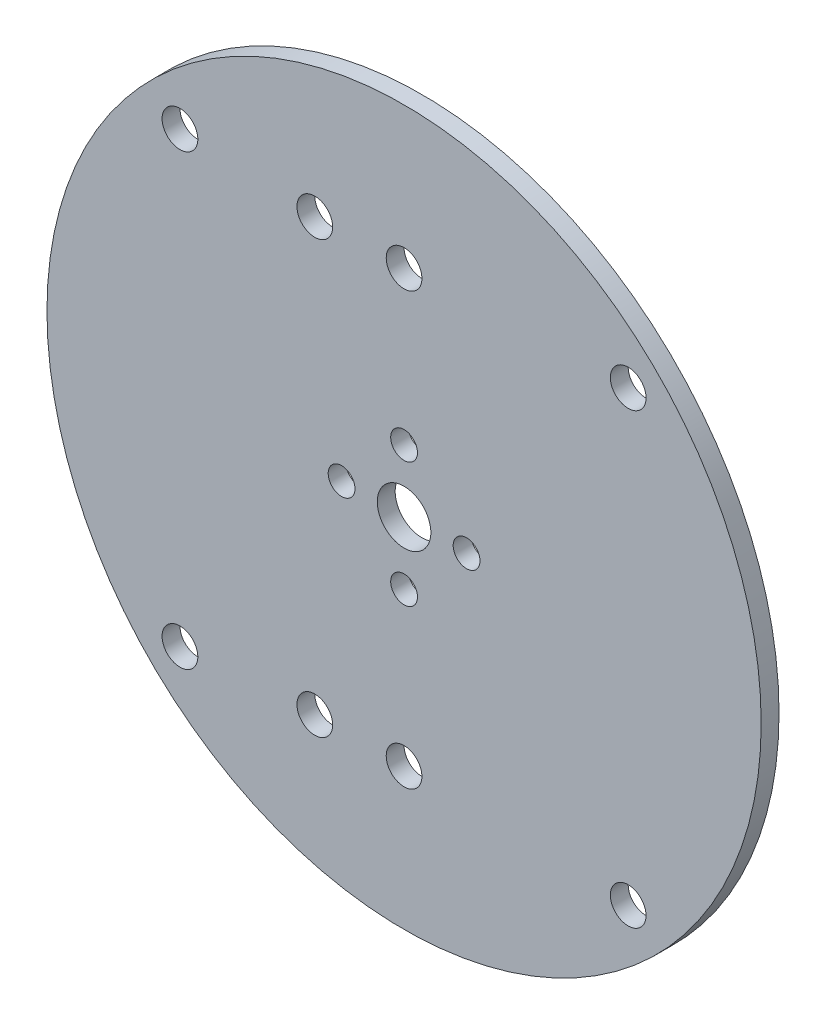
ISO-10303-21;
HEADER;
FILE_DESCRIPTION(('STEP AP214'),'2;1');
FILE_NAME('part.step','',(''),(''),'','','');
FILE_SCHEMA(('AUTOMOTIVE_DESIGN { 1 0 10303 214 1 1 1 1 }'));
ENDSEC;
DATA;
#1=APPLICATION_CONTEXT('core data for automotive mechanical design processes');
#2=APPLICATION_PROTOCOL_DEFINITION('international standard','automotive_design',2000,#1);
#3=PRODUCT_CONTEXT('',#1,'mechanical');
#4=PRODUCT('Part','Part','',(#3));
#5=PRODUCT_RELATED_PRODUCT_CATEGORY('part','',(#4));
#6=PRODUCT_DEFINITION_FORMATION('','',#4);
#7=PRODUCT_DEFINITION_CONTEXT('part definition',#1,'design');
#8=PRODUCT_DEFINITION('design','',#6,#7);
#9=PRODUCT_DEFINITION_SHAPE('','',#8);
#10=(LENGTH_UNIT() NAMED_UNIT(*) SI_UNIT(.MILLI.,.METRE.));
#11=(NAMED_UNIT(*) PLANE_ANGLE_UNIT() SI_UNIT($,.RADIAN.));
#12=(NAMED_UNIT(*) SI_UNIT($,.STERADIAN.) SOLID_ANGLE_UNIT());
#13=UNCERTAINTY_MEASURE_WITH_UNIT(LENGTH_MEASURE(1.E-05),#10,'distance_accuracy_value','');
#14=(GEOMETRIC_REPRESENTATION_CONTEXT(3) GLOBAL_UNCERTAINTY_ASSIGNED_CONTEXT((#13)) GLOBAL_UNIT_ASSIGNED_CONTEXT((#10,
#11,#12)) REPRESENTATION_CONTEXT('',''));
#15=CARTESIAN_POINT('',(0.,0.,0.));
#16=DIRECTION('',(0.,0.,1.));
#17=DIRECTION('',(1.,0.,0.));
#18=AXIS2_PLACEMENT_3D('',#15,#16,#17);
#19=CARTESIAN_POINT('',(64.7426065483763,40.5692941488828,2.));
#20=DIRECTION('',(0.,0.,1.));
#21=DIRECTION('',(1.,0.,0.));
#22=AXIS2_PLACEMENT_3D('',#19,#20,#21);
#23=PLANE('',#22);
#24=CARTESIAN_POINT('',(64.7426065483763,40.5692941488828,2.));
#25=DIRECTION('',(0.,0.,-1.));
#26=DIRECTION('',(-1.,0.,0.));
#27=AXIS2_PLACEMENT_3D('',#24,#25,#26);
#28=CIRCLE('',#27,40.);
#29=CARTESIAN_POINT('',(24.7426065483763,40.5692941488828,2.));
#30=VERTEX_POINT('',#29);
#31=EDGE_CURVE('E65',#30,#30,#28,.T.);
#32=ORIENTED_EDGE('',*,*,#31,.F.);
#33=EDGE_LOOP('',(#32));
#34=FACE_BOUND('',#33,.T.);
#35=CARTESIAN_POINT('',(64.7426065483763,40.5692941488828,2.));
#36=DIRECTION('',(0.,0.,-1.));
#37=DIRECTION('',(-1.,0.,0.));
#38=AXIS2_PLACEMENT_3D('',#35,#36,#37);
#39=CIRCLE('',#38,3.);
#40=CARTESIAN_POINT('',(61.7426065483763,40.5692941488828,2.));
#41=VERTEX_POINT('',#40);
#42=EDGE_CURVE('E68',#41,#41,#39,.T.);
#43=ORIENTED_EDGE('',*,*,#42,.T.);
#44=EDGE_LOOP('',(#43));
#45=FACE_BOUND('',#44,.T.);
#46=CARTESIAN_POINT('',(71.7426065483763,40.5692941488828,2.));
#47=DIRECTION('',(0.,0.,-1.));
#48=DIRECTION('',(-1.,0.,0.));
#49=AXIS2_PLACEMENT_3D('',#46,#47,#48);
#50=CIRCLE('',#49,1.49999999999995);
#51=CARTESIAN_POINT('',(70.2426065483764,40.5692941488828,2.));
#52=VERTEX_POINT('',#51);
#53=EDGE_CURVE('E71',#52,#52,#50,.T.);
#54=ORIENTED_EDGE('',*,*,#53,.T.);
#55=EDGE_LOOP('',(#54));
#56=FACE_BOUND('',#55,.T.);
#57=CARTESIAN_POINT('',(57.7426065483763,40.5692941488828,2.));
#58=DIRECTION('',(0.,0.,-1.));
#59=DIRECTION('',(-1.,0.,0.));
#60=AXIS2_PLACEMENT_3D('',#57,#58,#59);
#61=CIRCLE('',#60,1.49999999999995);
#62=CARTESIAN_POINT('',(56.2426065483764,40.5692941488828,2.));
#63=VERTEX_POINT('',#62);
#64=EDGE_CURVE('E74',#63,#63,#61,.T.);
#65=ORIENTED_EDGE('',*,*,#64,.T.);
#66=EDGE_LOOP('',(#65));
#67=FACE_BOUND('',#66,.T.);
#68=CARTESIAN_POINT('',(89.8448972804962,15.4670034167627,2.));
#69=DIRECTION('',(0.,0.,-1.));
#70=DIRECTION('',(-1.,0.,0.));
#71=AXIS2_PLACEMENT_3D('',#68,#69,#70);
#72=CIRCLE('',#71,2.);
#73=CARTESIAN_POINT('',(87.8448972804962,15.4670034167627,2.));
#74=VERTEX_POINT('',#73);
#75=EDGE_CURVE('E77',#74,#74,#72,.T.);
#76=ORIENTED_EDGE('',*,*,#75,.T.);
#77=EDGE_LOOP('',(#76));
#78=FACE_BOUND('',#77,.T.);
#79=CARTESIAN_POINT('',(54.7426065483772,64.7142941488828,2.));
#80=DIRECTION('',(0.,0.,-1.));
#81=DIRECTION('',(-1.,0.,0.));
#82=AXIS2_PLACEMENT_3D('',#79,#80,#81);
#83=CIRCLE('',#82,2.);
#84=CARTESIAN_POINT('',(52.7426065483772,64.7142941488828,2.));
#85=VERTEX_POINT('',#84);
#86=EDGE_CURVE('E80',#85,#85,#83,.T.);
#87=ORIENTED_EDGE('',*,*,#86,.T.);
#88=EDGE_LOOP('',(#87));
#89=FACE_BOUND('',#88,.T.);
#90=CARTESIAN_POINT('',(39.6403158162561,15.4670034167627,2.));
#91=DIRECTION('',(0.,0.,-1.));
#92=DIRECTION('',(-1.,0.,0.));
#93=AXIS2_PLACEMENT_3D('',#90,#91,#92);
#94=CIRCLE('',#93,2.);
#95=CARTESIAN_POINT('',(37.6403158162561,15.4670034167627,2.));
#96=VERTEX_POINT('',#95);
#97=EDGE_CURVE('E83',#96,#96,#94,.T.);
#98=ORIENTED_EDGE('',*,*,#97,.T.);
#99=EDGE_LOOP('',(#98));
#100=FACE_BOUND('',#99,.T.);
#101=CARTESIAN_POINT('',(89.8448972804962,65.6715848810028,2.));
#102=DIRECTION('',(0.,0.,-1.));
#103=DIRECTION('',(-1.,0.,0.));
#104=AXIS2_PLACEMENT_3D('',#101,#102,#103);
#105=CIRCLE('',#104,2.);
#106=CARTESIAN_POINT('',(87.8448972804962,65.6715848810028,2.));
#107=VERTEX_POINT('',#106);
#108=EDGE_CURVE('E86',#107,#107,#105,.T.);
#109=ORIENTED_EDGE('',*,*,#108,.T.);
#110=EDGE_LOOP('',(#109));
#111=FACE_BOUND('',#110,.T.);
#112=CARTESIAN_POINT('',(39.6403158162561,65.6715848810028,2.));
#113=DIRECTION('',(0.,0.,-1.));
#114=DIRECTION('',(-1.,0.,0.));
#115=AXIS2_PLACEMENT_3D('',#112,#113,#114);
#116=CIRCLE('',#115,2.);
#117=CARTESIAN_POINT('',(37.6403158162561,65.6715848810028,2.));
#118=VERTEX_POINT('',#117);
#119=EDGE_CURVE('E89',#118,#118,#116,.T.);
#120=ORIENTED_EDGE('',*,*,#119,.T.);
#121=EDGE_LOOP('',(#120));
#122=FACE_BOUND('',#121,.T.);
#123=CARTESIAN_POINT('',(64.7426065483763,64.7142941488828,2.));
#124=DIRECTION('',(0.,0.,-1.));
#125=DIRECTION('',(-1.,0.,0.));
#126=AXIS2_PLACEMENT_3D('',#123,#124,#125);
#127=CIRCLE('',#126,2.);
#128=CARTESIAN_POINT('',(62.7426065483763,64.7142941488828,2.));
#129=VERTEX_POINT('',#128);
#130=EDGE_CURVE('E92',#129,#129,#127,.T.);
#131=ORIENTED_EDGE('',*,*,#130,.T.);
#132=EDGE_LOOP('',(#131));
#133=FACE_BOUND('',#132,.T.);
#134=CARTESIAN_POINT('',(64.7426065483763,16.4142941488828,2.));
#135=DIRECTION('',(0.,0.,-1.));
#136=DIRECTION('',(-1.,0.,0.));
#137=AXIS2_PLACEMENT_3D('',#134,#135,#136);
#138=CIRCLE('',#137,2.);
#139=CARTESIAN_POINT('',(62.7426065483763,16.4142941488828,2.));
#140=VERTEX_POINT('',#139);
#141=EDGE_CURVE('E95',#140,#140,#138,.T.);
#142=ORIENTED_EDGE('',*,*,#141,.T.);
#143=EDGE_LOOP('',(#142));
#144=FACE_BOUND('',#143,.T.);
#145=CARTESIAN_POINT('',(64.7426065483763,33.5692941488828,2.));
#146=DIRECTION('',(0.,0.,-1.));
#147=DIRECTION('',(-1.,0.,0.));
#148=AXIS2_PLACEMENT_3D('',#145,#146,#147);
#149=CIRCLE('',#148,1.49999999999995);
#150=CARTESIAN_POINT('',(63.2426065483764,33.5692941488828,2.));
#151=VERTEX_POINT('',#150);
#152=EDGE_CURVE('E98',#151,#151,#149,.T.);
#153=ORIENTED_EDGE('',*,*,#152,.T.);
#154=EDGE_LOOP('',(#153));
#155=FACE_BOUND('',#154,.T.);
#156=CARTESIAN_POINT('',(64.7426065483763,47.5692941488828,2.));
#157=DIRECTION('',(0.,0.,-1.));
#158=DIRECTION('',(-1.,0.,0.));
#159=AXIS2_PLACEMENT_3D('',#156,#157,#158);
#160=CIRCLE('',#159,1.49999999999995);
#161=CARTESIAN_POINT('',(63.2426065483764,47.5692941488828,2.));
#162=VERTEX_POINT('',#161);
#163=EDGE_CURVE('E100',#162,#162,#160,.T.);
#164=ORIENTED_EDGE('',*,*,#163,.T.);
#165=EDGE_LOOP('',(#164));
#166=FACE_BOUND('',#165,.T.);
#167=CARTESIAN_POINT('',(54.7426065483772,16.4142941488828,2.));
#168=DIRECTION('',(0.,0.,-1.));
#169=DIRECTION('',(-1.,0.,0.));
#170=AXIS2_PLACEMENT_3D('',#167,#168,#169);
#171=CIRCLE('',#170,2.);
#172=CARTESIAN_POINT('',(52.7426065483772,16.4142941488828,2.));
#173=VERTEX_POINT('',#172);
#174=EDGE_CURVE('E18',#173,#173,#171,.T.);
#175=ORIENTED_EDGE('',*,*,#174,.T.);
#176=EDGE_LOOP('',(#175));
#177=FACE_BOUND('',#176,.T.);
#178=ADVANCED_FACE('F15',(#34,#45,#56,#67,#78,#89,#100,#111,#122,#133,#144,#155,#166,#177),#23,.T.);
#179=CARTESIAN_POINT('',(54.7426065483772,16.4142941488828,2.));
#180=DIRECTION('',(0.,0.,-1.));
#181=DIRECTION('',(-1.,0.,0.));
#182=AXIS2_PLACEMENT_3D('',#179,#180,#181);
#183=CYLINDRICAL_SURFACE('',#182,2.);
#184=CARTESIAN_POINT('',(54.7426065483772,16.4142941488828,0.));
#185=DIRECTION('',(0.,0.,-1.));
#186=DIRECTION('',(-1.,0.,0.));
#187=AXIS2_PLACEMENT_3D('',#184,#185,#186);
#188=CIRCLE('',#187,2.);
#189=CARTESIAN_POINT('',(52.7426065483772,16.4142941488828,0.));
#190=VERTEX_POINT('',#189);
#191=EDGE_CURVE('E62',#190,#190,#188,.T.);
#192=ORIENTED_EDGE('',*,*,#191,.T.);
#193=EDGE_LOOP('',(#192));
#194=FACE_BOUND('',#193,.T.);
#195=ORIENTED_EDGE('',*,*,#174,.F.);
#196=EDGE_LOOP('',(#195));
#197=FACE_BOUND('',#196,.T.);
#198=ADVANCED_FACE('F108',(#194,#197),#183,.F.);
#199=CARTESIAN_POINT('',(64.7426065483763,47.5692941488828,2.));
#200=DIRECTION('',(0.,0.,-1.));
#201=DIRECTION('',(-1.,0.,0.));
#202=AXIS2_PLACEMENT_3D('',#199,#200,#201);
#203=CYLINDRICAL_SURFACE('',#202,1.49999999999995);
#204=CARTESIAN_POINT('',(64.7426065483763,47.5692941488828,0.));
#205=DIRECTION('',(0.,0.,-1.));
#206=DIRECTION('',(-1.,0.,0.));
#207=AXIS2_PLACEMENT_3D('',#204,#205,#206);
#208=CIRCLE('',#207,1.49999999999995);
#209=CARTESIAN_POINT('',(63.2426065483764,47.5692941488828,0.));
#210=VERTEX_POINT('',#209);
#211=EDGE_CURVE('E59',#210,#210,#208,.T.);
#212=ORIENTED_EDGE('',*,*,#211,.T.);
#213=EDGE_LOOP('',(#212));
#214=FACE_BOUND('',#213,.T.);
#215=ORIENTED_EDGE('',*,*,#163,.F.);
#216=EDGE_LOOP('',(#215));
#217=FACE_BOUND('',#216,.T.);
#218=ADVANCED_FACE('F110',(#214,#217),#203,.F.);
#219=CARTESIAN_POINT('',(64.7426065483763,33.5692941488828,2.));
#220=DIRECTION('',(0.,0.,-1.));
#221=DIRECTION('',(-1.,0.,0.));
#222=AXIS2_PLACEMENT_3D('',#219,#220,#221);
#223=CYLINDRICAL_SURFACE('',#222,1.49999999999995);
#224=CARTESIAN_POINT('',(64.7426065483763,33.5692941488828,0.));
#225=DIRECTION('',(0.,0.,-1.));
#226=DIRECTION('',(-1.,0.,0.));
#227=AXIS2_PLACEMENT_3D('',#224,#225,#226);
#228=CIRCLE('',#227,1.49999999999995);
#229=CARTESIAN_POINT('',(63.2426065483764,33.5692941488828,0.));
#230=VERTEX_POINT('',#229);
#231=EDGE_CURVE('E56',#230,#230,#228,.T.);
#232=ORIENTED_EDGE('',*,*,#231,.T.);
#233=EDGE_LOOP('',(#232));
#234=FACE_BOUND('',#233,.T.);
#235=ORIENTED_EDGE('',*,*,#152,.F.);
#236=EDGE_LOOP('',(#235));
#237=FACE_BOUND('',#236,.T.);
#238=ADVANCED_FACE('F117',(#234,#237),#223,.F.);
#239=CARTESIAN_POINT('',(64.7426065483763,16.4142941488828,2.));
#240=DIRECTION('',(0.,0.,-1.));
#241=DIRECTION('',(-1.,0.,0.));
#242=AXIS2_PLACEMENT_3D('',#239,#240,#241);
#243=CYLINDRICAL_SURFACE('',#242,2.);
#244=CARTESIAN_POINT('',(64.7426065483763,16.4142941488828,0.));
#245=DIRECTION('',(0.,0.,-1.));
#246=DIRECTION('',(-1.,0.,0.));
#247=AXIS2_PLACEMENT_3D('',#244,#245,#246);
#248=CIRCLE('',#247,2.);
#249=CARTESIAN_POINT('',(62.7426065483763,16.4142941488828,0.));
#250=VERTEX_POINT('',#249);
#251=EDGE_CURVE('E53',#250,#250,#248,.T.);
#252=ORIENTED_EDGE('',*,*,#251,.T.);
#253=EDGE_LOOP('',(#252));
#254=FACE_BOUND('',#253,.T.);
#255=ORIENTED_EDGE('',*,*,#141,.F.);
#256=EDGE_LOOP('',(#255));
#257=FACE_BOUND('',#256,.T.);
#258=ADVANCED_FACE('F168',(#254,#257),#243,.F.);
#259=CARTESIAN_POINT('',(64.7426065483763,64.7142941488828,2.));
#260=DIRECTION('',(0.,0.,-1.));
#261=DIRECTION('',(-1.,0.,0.));
#262=AXIS2_PLACEMENT_3D('',#259,#260,#261);
#263=CYLINDRICAL_SURFACE('',#262,2.);
#264=CARTESIAN_POINT('',(64.7426065483763,64.7142941488828,0.));
#265=DIRECTION('',(0.,0.,-1.));
#266=DIRECTION('',(-1.,0.,0.));
#267=AXIS2_PLACEMENT_3D('',#264,#265,#266);
#268=CIRCLE('',#267,2.);
#269=CARTESIAN_POINT('',(62.7426065483763,64.7142941488828,0.));
#270=VERTEX_POINT('',#269);
#271=EDGE_CURVE('E50',#270,#270,#268,.T.);
#272=ORIENTED_EDGE('',*,*,#271,.T.);
#273=EDGE_LOOP('',(#272));
#274=FACE_BOUND('',#273,.T.);
#275=ORIENTED_EDGE('',*,*,#130,.F.);
#276=EDGE_LOOP('',(#275));
#277=FACE_BOUND('',#276,.T.);
#278=ADVANCED_FACE('F164',(#274,#277),#263,.F.);
#279=CARTESIAN_POINT('',(39.6403158162561,65.6715848810028,2.));
#280=DIRECTION('',(0.,0.,-1.));
#281=DIRECTION('',(-1.,0.,0.));
#282=AXIS2_PLACEMENT_3D('',#279,#280,#281);
#283=CYLINDRICAL_SURFACE('',#282,2.);
#284=CARTESIAN_POINT('',(39.6403158162561,65.6715848810028,0.));
#285=DIRECTION('',(0.,0.,-1.));
#286=DIRECTION('',(-1.,0.,0.));
#287=AXIS2_PLACEMENT_3D('',#284,#285,#286);
#288=CIRCLE('',#287,2.);
#289=CARTESIAN_POINT('',(37.6403158162561,65.6715848810028,0.));
#290=VERTEX_POINT('',#289);
#291=EDGE_CURVE('E47',#290,#290,#288,.T.);
#292=ORIENTED_EDGE('',*,*,#291,.T.);
#293=EDGE_LOOP('',(#292));
#294=FACE_BOUND('',#293,.T.);
#295=ORIENTED_EDGE('',*,*,#119,.F.);
#296=EDGE_LOOP('',(#295));
#297=FACE_BOUND('',#296,.T.);
#298=ADVANCED_FACE('F160',(#294,#297),#283,.F.);
#299=CARTESIAN_POINT('',(89.8448972804962,65.6715848810028,2.));
#300=DIRECTION('',(0.,0.,-1.));
#301=DIRECTION('',(-1.,0.,0.));
#302=AXIS2_PLACEMENT_3D('',#299,#300,#301);
#303=CYLINDRICAL_SURFACE('',#302,2.);
#304=CARTESIAN_POINT('',(89.8448972804962,65.6715848810028,0.));
#305=DIRECTION('',(0.,0.,-1.));
#306=DIRECTION('',(-1.,0.,0.));
#307=AXIS2_PLACEMENT_3D('',#304,#305,#306);
#308=CIRCLE('',#307,2.);
#309=CARTESIAN_POINT('',(87.8448972804962,65.6715848810028,0.));
#310=VERTEX_POINT('',#309);
#311=EDGE_CURVE('E44',#310,#310,#308,.T.);
#312=ORIENTED_EDGE('',*,*,#311,.T.);
#313=EDGE_LOOP('',(#312));
#314=FACE_BOUND('',#313,.T.);
#315=ORIENTED_EDGE('',*,*,#108,.F.);
#316=EDGE_LOOP('',(#315));
#317=FACE_BOUND('',#316,.T.);
#318=ADVANCED_FACE('F156',(#314,#317),#303,.F.);
#319=CARTESIAN_POINT('',(39.6403158162561,15.4670034167627,2.));
#320=DIRECTION('',(0.,0.,-1.));
#321=DIRECTION('',(-1.,0.,0.));
#322=AXIS2_PLACEMENT_3D('',#319,#320,#321);
#323=CYLINDRICAL_SURFACE('',#322,2.);
#324=CARTESIAN_POINT('',(39.6403158162561,15.4670034167627,0.));
#325=DIRECTION('',(0.,0.,-1.));
#326=DIRECTION('',(-1.,0.,0.));
#327=AXIS2_PLACEMENT_3D('',#324,#325,#326);
#328=CIRCLE('',#327,2.);
#329=CARTESIAN_POINT('',(37.6403158162561,15.4670034167627,0.));
#330=VERTEX_POINT('',#329);
#331=EDGE_CURVE('E41',#330,#330,#328,.T.);
#332=ORIENTED_EDGE('',*,*,#331,.T.);
#333=EDGE_LOOP('',(#332));
#334=FACE_BOUND('',#333,.T.);
#335=ORIENTED_EDGE('',*,*,#97,.F.);
#336=EDGE_LOOP('',(#335));
#337=FACE_BOUND('',#336,.T.);
#338=ADVANCED_FACE('F152',(#334,#337),#323,.F.);
#339=CARTESIAN_POINT('',(54.7426065483772,64.7142941488828,2.));
#340=DIRECTION('',(0.,0.,-1.));
#341=DIRECTION('',(-1.,0.,0.));
#342=AXIS2_PLACEMENT_3D('',#339,#340,#341);
#343=CYLINDRICAL_SURFACE('',#342,2.);
#344=CARTESIAN_POINT('',(54.7426065483772,64.7142941488828,0.));
#345=DIRECTION('',(0.,0.,-1.));
#346=DIRECTION('',(-1.,0.,0.));
#347=AXIS2_PLACEMENT_3D('',#344,#345,#346);
#348=CIRCLE('',#347,2.);
#349=CARTESIAN_POINT('',(52.7426065483772,64.7142941488828,0.));
#350=VERTEX_POINT('',#349);
#351=EDGE_CURVE('E38',#350,#350,#348,.T.);
#352=ORIENTED_EDGE('',*,*,#351,.T.);
#353=EDGE_LOOP('',(#352));
#354=FACE_BOUND('',#353,.T.);
#355=ORIENTED_EDGE('',*,*,#86,.F.);
#356=EDGE_LOOP('',(#355));
#357=FACE_BOUND('',#356,.T.);
#358=ADVANCED_FACE('F148',(#354,#357),#343,.F.);
#359=CARTESIAN_POINT('',(89.8448972804962,15.4670034167627,2.));
#360=DIRECTION('',(0.,0.,-1.));
#361=DIRECTION('',(-1.,0.,0.));
#362=AXIS2_PLACEMENT_3D('',#359,#360,#361);
#363=CYLINDRICAL_SURFACE('',#362,2.);
#364=CARTESIAN_POINT('',(89.8448972804962,15.4670034167627,0.));
#365=DIRECTION('',(0.,0.,-1.));
#366=DIRECTION('',(-1.,0.,0.));
#367=AXIS2_PLACEMENT_3D('',#364,#365,#366);
#368=CIRCLE('',#367,2.);
#369=CARTESIAN_POINT('',(87.8448972804962,15.4670034167627,0.));
#370=VERTEX_POINT('',#369);
#371=EDGE_CURVE('E35',#370,#370,#368,.T.);
#372=ORIENTED_EDGE('',*,*,#371,.T.);
#373=EDGE_LOOP('',(#372));
#374=FACE_BOUND('',#373,.T.);
#375=ORIENTED_EDGE('',*,*,#75,.F.);
#376=EDGE_LOOP('',(#375));
#377=FACE_BOUND('',#376,.T.);
#378=ADVANCED_FACE('F144',(#374,#377),#363,.F.);
#379=CARTESIAN_POINT('',(57.7426065483763,40.5692941488828,2.));
#380=DIRECTION('',(0.,0.,-1.));
#381=DIRECTION('',(-1.,0.,0.));
#382=AXIS2_PLACEMENT_3D('',#379,#380,#381);
#383=CYLINDRICAL_SURFACE('',#382,1.49999999999995);
#384=CARTESIAN_POINT('',(57.7426065483763,40.5692941488828,0.));
#385=DIRECTION('',(0.,0.,-1.));
#386=DIRECTION('',(-1.,0.,0.));
#387=AXIS2_PLACEMENT_3D('',#384,#385,#386);
#388=CIRCLE('',#387,1.49999999999995);
#389=CARTESIAN_POINT('',(56.2426065483764,40.5692941488828,0.));
#390=VERTEX_POINT('',#389);
#391=EDGE_CURVE('E32',#390,#390,#388,.T.);
#392=ORIENTED_EDGE('',*,*,#391,.T.);
#393=EDGE_LOOP('',(#392));
#394=FACE_BOUND('',#393,.T.);
#395=ORIENTED_EDGE('',*,*,#64,.F.);
#396=EDGE_LOOP('',(#395));
#397=FACE_BOUND('',#396,.T.);
#398=ADVANCED_FACE('F140',(#394,#397),#383,.F.);
#399=CARTESIAN_POINT('',(71.7426065483763,40.5692941488828,2.));
#400=DIRECTION('',(0.,0.,-1.));
#401=DIRECTION('',(-1.,0.,0.));
#402=AXIS2_PLACEMENT_3D('',#399,#400,#401);
#403=CYLINDRICAL_SURFACE('',#402,1.49999999999995);
#404=CARTESIAN_POINT('',(71.7426065483763,40.5692941488828,0.));
#405=DIRECTION('',(0.,0.,-1.));
#406=DIRECTION('',(-1.,0.,0.));
#407=AXIS2_PLACEMENT_3D('',#404,#405,#406);
#408=CIRCLE('',#407,1.49999999999995);
#409=CARTESIAN_POINT('',(70.2426065483764,40.5692941488828,0.));
#410=VERTEX_POINT('',#409);
#411=EDGE_CURVE('E27',#410,#410,#408,.T.);
#412=ORIENTED_EDGE('',*,*,#411,.T.);
#413=EDGE_LOOP('',(#412));
#414=FACE_BOUND('',#413,.T.);
#415=ORIENTED_EDGE('',*,*,#53,.F.);
#416=EDGE_LOOP('',(#415));
#417=FACE_BOUND('',#416,.T.);
#418=ADVANCED_FACE('F136',(#414,#417),#403,.F.);
#419=CARTESIAN_POINT('',(64.7426065483763,40.5692941488828,2.));
#420=DIRECTION('',(0.,0.,-1.));
#421=DIRECTION('',(-1.,0.,0.));
#422=AXIS2_PLACEMENT_3D('',#419,#420,#421);
#423=CYLINDRICAL_SURFACE('',#422,3.);
#424=CARTESIAN_POINT('',(64.7426065483763,40.5692941488828,0.));
#425=DIRECTION('',(0.,0.,-1.));
#426=DIRECTION('',(-1.,0.,0.));
#427=AXIS2_PLACEMENT_3D('',#424,#425,#426);
#428=CIRCLE('',#427,3.);
#429=CARTESIAN_POINT('',(61.7426065483763,40.5692941488828,0.));
#430=VERTEX_POINT('',#429);
#431=EDGE_CURVE('E22',#430,#430,#428,.T.);
#432=ORIENTED_EDGE('',*,*,#431,.T.);
#433=EDGE_LOOP('',(#432));
#434=FACE_BOUND('',#433,.T.);
#435=ORIENTED_EDGE('',*,*,#42,.F.);
#436=EDGE_LOOP('',(#435));
#437=FACE_BOUND('',#436,.T.);
#438=ADVANCED_FACE('F129',(#434,#437),#423,.F.);
#439=CARTESIAN_POINT('',(64.7426065483763,40.5692941488828,2.));
#440=DIRECTION('',(0.,0.,-1.));
#441=DIRECTION('',(-1.,0.,0.));
#442=AXIS2_PLACEMENT_3D('',#439,#440,#441);
#443=CYLINDRICAL_SURFACE('',#442,40.);
#444=ORIENTED_EDGE('',*,*,#31,.T.);
#445=EDGE_LOOP('',(#444));
#446=FACE_BOUND('',#445,.T.);
#447=CARTESIAN_POINT('',(64.7426065483763,40.5692941488828,0.));
#448=DIRECTION('',(0.,0.,-1.));
#449=DIRECTION('',(-1.,0.,0.));
#450=AXIS2_PLACEMENT_3D('',#447,#448,#449);
#451=CIRCLE('',#450,40.);
#452=CARTESIAN_POINT('',(24.7426065483763,40.5692941488828,0.));
#453=VERTEX_POINT('',#452);
#454=EDGE_CURVE('E10',#453,#453,#451,.F.);
#455=ORIENTED_EDGE('',*,*,#454,.T.);
#456=EDGE_LOOP('',(#455));
#457=FACE_BOUND('',#456,.T.);
#458=ADVANCED_FACE('F123',(#446,#457),#443,.T.);
#459=CARTESIAN_POINT('',(64.7426065483763,40.5692941488828,0.));
#460=DIRECTION('',(0.,0.,1.));
#461=DIRECTION('',(1.,0.,0.));
#462=AXIS2_PLACEMENT_3D('',#459,#460,#461);
#463=PLANE('',#462);
#464=ORIENTED_EDGE('',*,*,#454,.F.);
#465=EDGE_LOOP('',(#464));
#466=FACE_BOUND('',#465,.T.);
#467=ORIENTED_EDGE('',*,*,#431,.F.);
#468=EDGE_LOOP('',(#467));
#469=FACE_BOUND('',#468,.T.);
#470=ORIENTED_EDGE('',*,*,#411,.F.);
#471=EDGE_LOOP('',(#470));
#472=FACE_BOUND('',#471,.T.);
#473=ORIENTED_EDGE('',*,*,#391,.F.);
#474=EDGE_LOOP('',(#473));
#475=FACE_BOUND('',#474,.T.);
#476=ORIENTED_EDGE('',*,*,#371,.F.);
#477=EDGE_LOOP('',(#476));
#478=FACE_BOUND('',#477,.T.);
#479=ORIENTED_EDGE('',*,*,#351,.F.);
#480=EDGE_LOOP('',(#479));
#481=FACE_BOUND('',#480,.T.);
#482=ORIENTED_EDGE('',*,*,#331,.F.);
#483=EDGE_LOOP('',(#482));
#484=FACE_BOUND('',#483,.T.);
#485=ORIENTED_EDGE('',*,*,#311,.F.);
#486=EDGE_LOOP('',(#485));
#487=FACE_BOUND('',#486,.T.);
#488=ORIENTED_EDGE('',*,*,#291,.F.);
#489=EDGE_LOOP('',(#488));
#490=FACE_BOUND('',#489,.T.);
#491=ORIENTED_EDGE('',*,*,#271,.F.);
#492=EDGE_LOOP('',(#491));
#493=FACE_BOUND('',#492,.T.);
#494=ORIENTED_EDGE('',*,*,#251,.F.);
#495=EDGE_LOOP('',(#494));
#496=FACE_BOUND('',#495,.T.);
#497=ORIENTED_EDGE('',*,*,#231,.F.);
#498=EDGE_LOOP('',(#497));
#499=FACE_BOUND('',#498,.T.);
#500=ORIENTED_EDGE('',*,*,#211,.F.);
#501=EDGE_LOOP('',(#500));
#502=FACE_BOUND('',#501,.T.);
#503=ORIENTED_EDGE('',*,*,#191,.F.);
#504=EDGE_LOOP('',(#503));
#505=FACE_BOUND('',#504,.T.);
#506=ADVANCED_FACE('F121',(#466,#469,#472,#475,#478,#481,#484,#487,#490,#493,#496,#499,#502,
#505),#463,.F.);
#507=CLOSED_SHELL('',(#178,#198,#218,#238,#258,#278,#298,#318,#338,#358,#378,#398,#418,#438,
#458,#506));
#508=MANIFOLD_SOLID_BREP('B1',#507);
#509=ADVANCED_BREP_SHAPE_REPRESENTATION('',(#18,#508),#14);
#510=SHAPE_DEFINITION_REPRESENTATION(#9,#509);
ENDSEC;
END-ISO-10303-21;
